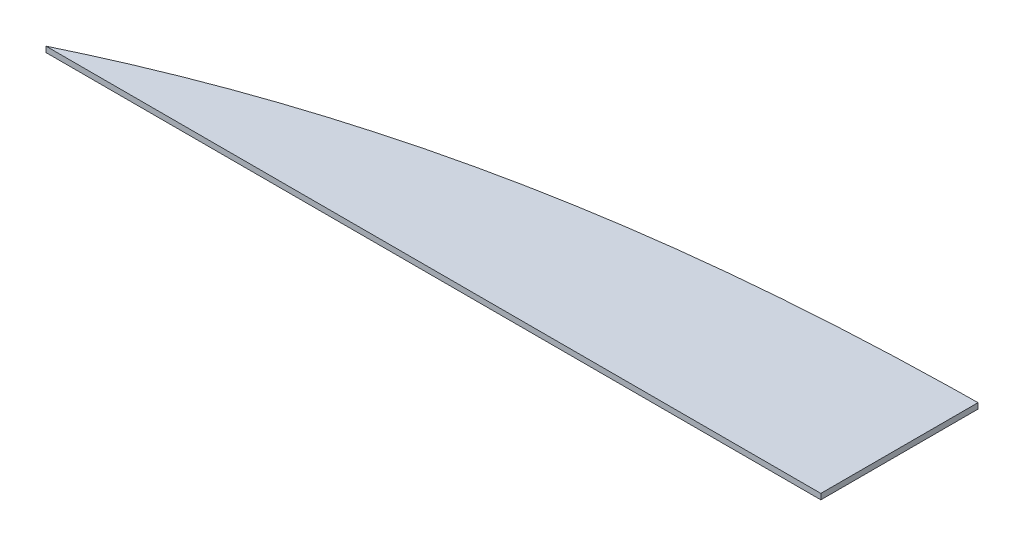
ISO-10303-21;
HEADER;
FILE_DESCRIPTION(('STEP AP214'),'2;1');
FILE_NAME('part.step','',(''),(''),'','','');
FILE_SCHEMA(('AUTOMOTIVE_DESIGN { 1 0 10303 214 1 1 1 1 }'));
ENDSEC;
DATA;
#1=APPLICATION_CONTEXT('core data for automotive mechanical design processes');
#2=APPLICATION_PROTOCOL_DEFINITION('international standard','automotive_design',2000,#1);
#3=PRODUCT_CONTEXT('',#1,'mechanical');
#4=PRODUCT('Part','Part','',(#3));
#5=PRODUCT_RELATED_PRODUCT_CATEGORY('part','',(#4));
#6=PRODUCT_DEFINITION_FORMATION('','',#4);
#7=PRODUCT_DEFINITION_CONTEXT('part definition',#1,'design');
#8=PRODUCT_DEFINITION('design','',#6,#7);
#9=PRODUCT_DEFINITION_SHAPE('','',#8);
#10=(LENGTH_UNIT() NAMED_UNIT(*) SI_UNIT(.MILLI.,.METRE.));
#11=(NAMED_UNIT(*) PLANE_ANGLE_UNIT() SI_UNIT($,.RADIAN.));
#12=(NAMED_UNIT(*) SI_UNIT($,.STERADIAN.) SOLID_ANGLE_UNIT());
#13=UNCERTAINTY_MEASURE_WITH_UNIT(LENGTH_MEASURE(1.E-05),#10,'distance_accuracy_value','');
#14=(GEOMETRIC_REPRESENTATION_CONTEXT(3) GLOBAL_UNCERTAINTY_ASSIGNED_CONTEXT((#13)) GLOBAL_UNIT_ASSIGNED_CONTEXT((#10,
#11,#12)) REPRESENTATION_CONTEXT('',''));
#15=CARTESIAN_POINT('',(0.,0.,0.));
#16=DIRECTION('',(0.,0.,1.));
#17=DIRECTION('',(1.,0.,0.));
#18=AXIS2_PLACEMENT_3D('',#15,#16,#17);
#19=CARTESIAN_POINT('',(-47.5491982307663,1827.86710603682,1121.25455636952));
#20=DIRECTION('',(-1.,0.,0.));
#21=DIRECTION('',(0.,0.,1.));
#22=AXIS2_PLACEMENT_3D('',#19,#20,#21);
#23=PLANE('',#22);
#24=DIRECTION('',(0.,0.,-1.));
#25=VECTOR('',#24,1.);
#26=CARTESIAN_POINT('',(-47.5491982307663,1821.51710603682,1121.25455636952));
#27=LINE('',#26,#25);
#28=CARTESIAN_POINT('',(-47.5491982307663,1821.51710603682,1121.25455636952));
#29=VERTEX_POINT('',#28);
#30=CARTESIAN_POINT('',(-47.5491982307663,1821.51710603682,943.454556369519));
#31=VERTEX_POINT('',#30);
#32=EDGE_CURVE('E116',#29,#31,#27,.T.);
#33=ORIENTED_EDGE('',*,*,#32,.T.);
#34=DIRECTION('',(0.,-1.,0.));
#35=VECTOR('',#34,1.);
#36=CARTESIAN_POINT('',(-47.5491982307663,1827.86710603682,943.454556369519));
#37=LINE('',#36,#35);
#38=CARTESIAN_POINT('',(-47.5491982307663,1827.86710603682,943.454556369519));
#39=VERTEX_POINT('',#38);
#40=EDGE_CURVE('E11',#39,#31,#37,.T.);
#41=ORIENTED_EDGE('',*,*,#40,.F.);
#42=DIRECTION('',(0.,0.,-1.));
#43=VECTOR('',#42,1.);
#44=CARTESIAN_POINT('',(-47.5491982307663,1827.86710603682,1121.25455636952));
#45=LINE('',#44,#43);
#46=CARTESIAN_POINT('',(-47.5491982307663,1827.86710603682,1121.25455636952));
#47=VERTEX_POINT('',#46);
#48=EDGE_CURVE('E84',#47,#39,#45,.T.);
#49=ORIENTED_EDGE('',*,*,#48,.F.);
#50=DIRECTION('',(0.,-1.,0.));
#51=VECTOR('',#50,1.);
#52=CARTESIAN_POINT('',(-47.5491982307663,1827.86710603682,1121.25455636952));
#53=LINE('',#52,#51);
#54=EDGE_CURVE('E92',#47,#29,#53,.T.);
#55=ORIENTED_EDGE('',*,*,#54,.T.);
#56=EDGE_LOOP('',(#33,#41,#49,#55));
#57=FACE_BOUND('',#56,.T.);
#58=ADVANCED_FACE('F33',(#57),#23,.F.);
#59=CARTESIAN_POINT('',(-77.5443664126402,1827.86710603682,943.874612266255));
#60=DIRECTION('',(0.014002745727019,0.,0.999901956749813));
#61=DIRECTION('',(0.999901956749813,0.,-0.014002745727019));
#62=AXIS2_PLACEMENT_3D('',#59,#60,#61);
#63=PLANE('',#62);
#64=DIRECTION('',(-0.999901956749813,0.,0.014002745727019));
#65=VECTOR('',#64,1.);
#66=CARTESIAN_POINT('',(-77.5443664126402,1821.51710603682,943.874612266255));
#67=LINE('',#66,#65);
#68=CARTESIAN_POINT('',(-77.5443664126394,1821.51710603682,943.874612266255));
#69=VERTEX_POINT('',#68);
#70=EDGE_CURVE('E88',#31,#69,#67,.T.);
#71=ORIENTED_EDGE('',*,*,#70,.T.);
#72=DIRECTION('',(0.,-1.,0.));
#73=VECTOR('',#72,1.);
#74=CARTESIAN_POINT('',(-77.5443664126394,1827.86710603682,943.874612266255));
#75=LINE('',#74,#73);
#76=CARTESIAN_POINT('',(-77.5443664126394,1827.86710603682,943.874612266255));
#77=VERTEX_POINT('',#76);
#78=EDGE_CURVE('E41',#77,#69,#75,.T.);
#79=ORIENTED_EDGE('',*,*,#78,.F.);
#80=DIRECTION('',(-0.999901956749813,0.,0.014002745727019));
#81=VECTOR('',#80,1.);
#82=CARTESIAN_POINT('',(-77.5443664126402,1827.86710603682,943.874612266255));
#83=LINE('',#82,#81);
#84=EDGE_CURVE('E79',#39,#77,#83,.T.);
#85=ORIENTED_EDGE('',*,*,#84,.F.);
#86=ORIENTED_EDGE('',*,*,#40,.T.);
#87=EDGE_LOOP('',(#71,#79,#85,#86));
#88=FACE_BOUND('',#87,.T.);
#89=ADVANCED_FACE('F87',(#88),#63,.F.);
#90=CARTESIAN_POINT('',(-77.5443664126394,1827.86710603682,943.874612266255));
#91=CARTESIAN_POINT('',(-393.287916180602,1827.86710603682,950.018435891416));
#92=CARTESIAN_POINT('',(-668.322445348646,1827.86710603682,997.526363485527));
#93=CARTESIAN_POINT('',(-924.028146258232,1827.86710603682,1121.35040015805));
#94=B_SPLINE_CURVE_WITH_KNOTS('',3,(#90,#91,#92,#93),.UNSPECIFIED.,.F.,.F.,(4,4),(0.,1.),.UNSPECIFIED.);
#95=DIRECTION('',(0.,-1.,0.));
#96=VECTOR('',#95,1.);
#97=SURFACE_OF_LINEAR_EXTRUSION('',#94,#96);
#98=CARTESIAN_POINT('',(-77.5443664126394,1821.51710603682,943.874612266255));
#99=CARTESIAN_POINT('',(-393.287916180602,1821.51710603682,950.018435891416));
#100=CARTESIAN_POINT('',(-668.322445348646,1821.51710603682,997.526363485527));
#101=CARTESIAN_POINT('',(-924.028146258232,1821.51710603682,1121.35040015805));
#102=B_SPLINE_CURVE_WITH_KNOTS('',3,(#98,#99,#100,#101),.UNSPECIFIED.,.F.,.F.,(4,4),(0.,1.),.UNSPECIFIED.);
#103=CARTESIAN_POINT('',(-924.028146258232,1821.51710603682,1121.35040015805));
#104=VERTEX_POINT('',#103);
#105=EDGE_CURVE('E66',#69,#104,#102,.T.);
#106=ORIENTED_EDGE('',*,*,#105,.T.);
#107=DIRECTION('',(0.,-1.,0.));
#108=VECTOR('',#107,1.);
#109=CARTESIAN_POINT('',(-924.028146258232,1827.86710603682,1121.35040015805));
#110=LINE('',#109,#108);
#111=CARTESIAN_POINT('',(-924.028146258232,1827.86710603682,1121.35040015805));
#112=VERTEX_POINT('',#111);
#113=EDGE_CURVE('E89',#112,#104,#110,.T.);
#114=ORIENTED_EDGE('',*,*,#113,.F.);
#115=EDGE_CURVE('E82',#77,#112,#94,.T.);
#116=ORIENTED_EDGE('',*,*,#115,.F.);
#117=ORIENTED_EDGE('',*,*,#78,.T.);
#118=EDGE_LOOP('',(#106,#114,#116,#117));
#119=FACE_BOUND('',#118,.T.);
#120=ADVANCED_FACE('F90',(#119),#97,.F.);
#121=CARTESIAN_POINT('',(-47.5491982307663,1827.86710603682,1121.25455636952));
#122=DIRECTION('',(-0.000109350929843278,0.,-0.999999994021187));
#123=DIRECTION('',(-0.999999994021187,0.,0.000109350929843278));
#124=AXIS2_PLACEMENT_3D('',#121,#122,#123);
#125=PLANE('',#124);
#126=DIRECTION('',(0.999999994021187,0.,-0.000109350929843278));
#127=VECTOR('',#126,1.);
#128=CARTESIAN_POINT('',(-47.5491982307663,1821.51710603682,1121.25455636952));
#129=LINE('',#128,#127);
#130=EDGE_CURVE('E72',#104,#29,#129,.T.);
#131=ORIENTED_EDGE('',*,*,#130,.T.);
#132=ORIENTED_EDGE('',*,*,#54,.F.);
#133=DIRECTION('',(0.999999994021187,0.,-0.000109350929843278));
#134=VECTOR('',#133,1.);
#135=CARTESIAN_POINT('',(-47.5491982307663,1827.86710603682,1121.25455636952));
#136=LINE('',#135,#134);
#137=EDGE_CURVE('E49',#112,#47,#136,.T.);
#138=ORIENTED_EDGE('',*,*,#137,.F.);
#139=ORIENTED_EDGE('',*,*,#113,.T.);
#140=EDGE_LOOP('',(#131,#132,#138,#139));
#141=FACE_BOUND('',#140,.T.);
#142=ADVANCED_FACE('F105',(#141),#125,.F.);
#143=CARTESIAN_POINT('',(-523.300449657327,1827.86710603682,988.482426319391));
#144=DIRECTION('',(0.,1.,0.));
#145=DIRECTION('',(0.,0.,1.));
#146=AXIS2_PLACEMENT_3D('',#143,#144,#145);
#147=PLANE('',#146);
#148=ORIENTED_EDGE('',*,*,#48,.T.);
#149=ORIENTED_EDGE('',*,*,#84,.T.);
#150=ORIENTED_EDGE('',*,*,#115,.T.);
#151=ORIENTED_EDGE('',*,*,#137,.T.);
#152=EDGE_LOOP('',(#148,#149,#150,#151));
#153=FACE_BOUND('',#152,.T.);
#154=ADVANCED_FACE('F80',(#153),#147,.T.);
#155=CARTESIAN_POINT('',(-523.300449657327,1821.51710603682,988.482426319391));
#156=DIRECTION('',(0.,1.,0.));
#157=DIRECTION('',(0.,0.,1.));
#158=AXIS2_PLACEMENT_3D('',#155,#156,#157);
#159=PLANE('',#158);
#160=ORIENTED_EDGE('',*,*,#32,.F.);
#161=ORIENTED_EDGE('',*,*,#130,.F.);
#162=ORIENTED_EDGE('',*,*,#105,.F.);
#163=ORIENTED_EDGE('',*,*,#70,.F.);
#164=EDGE_LOOP('',(#160,#161,#162,#163));
#165=FACE_BOUND('',#164,.T.);
#166=ADVANCED_FACE('F128',(#165),#159,.F.);
#167=CLOSED_SHELL('',(#58,#89,#120,#142,#154,#166));
#168=MANIFOLD_SOLID_BREP('B2',#167);
#169=ADVANCED_BREP_SHAPE_REPRESENTATION('',(#18,#168),#14);
#170=SHAPE_DEFINITION_REPRESENTATION(#9,#169);
ENDSEC;
END-ISO-10303-21;
